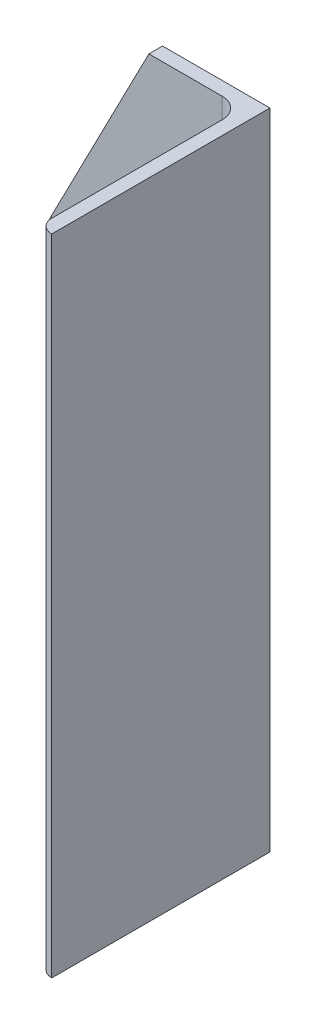
ISO-10303-21;
HEADER;
FILE_DESCRIPTION(('STEP AP214'),'2;1');
FILE_NAME('part.step','',(''),(''),'','','');
FILE_SCHEMA(('AUTOMOTIVE_DESIGN { 1 0 10303 214 1 1 1 1 }'));
ENDSEC;
DATA;
#1=APPLICATION_CONTEXT('core data for automotive mechanical design processes');
#2=APPLICATION_PROTOCOL_DEFINITION('international standard','automotive_design',2000,#1);
#3=PRODUCT_CONTEXT('',#1,'mechanical');
#4=PRODUCT('Part','Part','',(#3));
#5=PRODUCT_RELATED_PRODUCT_CATEGORY('part','',(#4));
#6=PRODUCT_DEFINITION_FORMATION('','',#4);
#7=PRODUCT_DEFINITION_CONTEXT('part definition',#1,'design');
#8=PRODUCT_DEFINITION('design','',#6,#7);
#9=PRODUCT_DEFINITION_SHAPE('','',#8);
#10=(LENGTH_UNIT() NAMED_UNIT(*) SI_UNIT(.MILLI.,.METRE.));
#11=(NAMED_UNIT(*) PLANE_ANGLE_UNIT() SI_UNIT($,.RADIAN.));
#12=(NAMED_UNIT(*) SI_UNIT($,.STERADIAN.) SOLID_ANGLE_UNIT());
#13=UNCERTAINTY_MEASURE_WITH_UNIT(LENGTH_MEASURE(1.E-05),#10,'distance_accuracy_value','');
#14=(GEOMETRIC_REPRESENTATION_CONTEXT(3) GLOBAL_UNCERTAINTY_ASSIGNED_CONTEXT((#13)) GLOBAL_UNIT_ASSIGNED_CONTEXT((#10,
#11,#12)) REPRESENTATION_CONTEXT('',''));
#15=CARTESIAN_POINT('',(0.,0.,0.));
#16=DIRECTION('',(0.,0.,1.));
#17=DIRECTION('',(1.,0.,0.));
#18=AXIS2_PLACEMENT_3D('',#15,#16,#17);
#19=CARTESIAN_POINT('',(-50.8,150.,0.));
#20=DIRECTION('',(0.,0.,1.));
#21=DIRECTION('',(1.,0.,0.));
#22=AXIS2_PLACEMENT_3D('',#19,#20,#21);
#23=PLANE('',#22);
#24=CARTESIAN_POINT('',(-17.9,9.88,0.));
#25=DIRECTION('',(0.,0.,-1.));
#26=DIRECTION('',(-1.,0.,0.));
#27=AXIS2_PLACEMENT_3D('',#24,#25,#26);
#28=CIRCLE('',#27,2.5);
#29=CARTESIAN_POINT('',(-20.4,9.88,0.));
#30=VERTEX_POINT('',#29);
#31=EDGE_CURVE('E338',#30,#30,#28,.T.);
#32=ORIENTED_EDGE('',*,*,#31,.F.);
#33=EDGE_LOOP('',(#32));
#34=FACE_BOUND('',#33,.T.);
#35=CARTESIAN_POINT('',(-45.4,90.13,0.));
#36=DIRECTION('',(0.,0.,-1.));
#37=DIRECTION('',(-1.,0.,0.));
#38=AXIS2_PLACEMENT_3D('',#35,#36,#37);
#39=CIRCLE('',#38,2.5);
#40=CARTESIAN_POINT('',(-47.9,90.13,0.));
#41=VERTEX_POINT('',#40);
#42=EDGE_CURVE('E342',#41,#41,#39,.T.);
#43=ORIENTED_EDGE('',*,*,#42,.F.);
#44=EDGE_LOOP('',(#43));
#45=FACE_BOUND('',#44,.T.);
#46=CARTESIAN_POINT('',(-17.9,90.13,0.));
#47=DIRECTION('',(0.,0.,-1.));
#48=DIRECTION('',(-1.,0.,0.));
#49=AXIS2_PLACEMENT_3D('',#46,#47,#48);
#50=CIRCLE('',#49,2.5);
#51=CARTESIAN_POINT('',(-20.4,90.13,0.));
#52=VERTEX_POINT('',#51);
#53=EDGE_CURVE('E346',#52,#52,#50,.T.);
#54=ORIENTED_EDGE('',*,*,#53,.F.);
#55=EDGE_LOOP('',(#54));
#56=FACE_BOUND('',#55,.T.);
#57=CARTESIAN_POINT('',(-45.4,9.88,0.));
#58=DIRECTION('',(0.,0.,-1.));
#59=DIRECTION('',(-1.,0.,0.));
#60=AXIS2_PLACEMENT_3D('',#57,#58,#59);
#61=CIRCLE('',#60,2.5);
#62=CARTESIAN_POINT('',(-47.9,9.88,0.));
#63=VERTEX_POINT('',#62);
#64=EDGE_CURVE('E160',#63,#63,#61,.T.);
#65=ORIENTED_EDGE('',*,*,#64,.F.);
#66=EDGE_LOOP('',(#65));
#67=FACE_BOUND('',#66,.T.);
#68=DIRECTION('',(0.,-1.,0.));
#69=VECTOR('',#68,1.);
#70=CARTESIAN_POINT('',(-50.8,150.,0.));
#71=LINE('',#70,#69);
#72=CARTESIAN_POINT('',(-50.8,100.,0.));
#73=VERTEX_POINT('',#72);
#74=CARTESIAN_POINT('',(-50.8,0.,0.));
#75=VERTEX_POINT('',#74);
#76=EDGE_CURVE('E77',#73,#75,#71,.T.);
#77=ORIENTED_EDGE('',*,*,#76,.F.);
#78=DIRECTION('',(-0.45855237116426,-0.888667385977248,0.));
#79=VECTOR('',#78,1.);
#80=CARTESIAN_POINT('',(-50.8,100.,0.));
#81=LINE('',#80,#79);
#82=CARTESIAN_POINT('',(-25.,150.,0.));
#83=VERTEX_POINT('',#82);
#84=EDGE_CURVE('E274',#83,#73,#81,.T.);
#85=ORIENTED_EDGE('',*,*,#84,.F.);
#86=DIRECTION('',(-1.,0.,0.));
#87=VECTOR('',#86,1.);
#88=CARTESIAN_POINT('',(-50.8,150.,0.));
#89=LINE('',#88,#87);
#90=CARTESIAN_POINT('',(0.,150.,0.));
#91=VERTEX_POINT('',#90);
#92=EDGE_CURVE('E226',#91,#83,#89,.T.);
#93=ORIENTED_EDGE('',*,*,#92,.F.);
#94=DIRECTION('',(0.,-1.,0.));
#95=VECTOR('',#94,1.);
#96=CARTESIAN_POINT('',(0.,150.,0.));
#97=LINE('',#96,#95);
#98=CARTESIAN_POINT('',(0.,0.,0.));
#99=VERTEX_POINT('',#98);
#100=EDGE_CURVE('E203',#91,#99,#97,.T.);
#101=ORIENTED_EDGE('',*,*,#100,.T.);
#102=DIRECTION('',(-1.,0.,0.));
#103=VECTOR('',#102,1.);
#104=CARTESIAN_POINT('',(-50.8,0.,0.));
#105=LINE('',#104,#103);
#106=EDGE_CURVE('E196',#99,#75,#105,.T.);
#107=ORIENTED_EDGE('',*,*,#106,.T.);
#108=EDGE_LOOP('',(#77,#85,#93,#101,#107));
#109=FACE_BOUND('',#108,.T.);
#110=ADVANCED_FACE('F70',(#34,#45,#56,#67,#109),#23,.F.);
#111=CARTESIAN_POINT('',(-50.8,150.,0.00508));
#112=DIRECTION('',(1.,0.,0.));
#113=DIRECTION('',(0.,0.,-1.));
#114=AXIS2_PLACEMENT_3D('',#111,#112,#113);
#115=PLANE('',#114);
#116=DIRECTION('',(0.,-1.,0.));
#117=VECTOR('',#116,1.);
#118=CARTESIAN_POINT('',(-50.8,150.,0.00507999999999903));
#119=LINE('',#118,#117);
#120=CARTESIAN_POINT('',(-50.8,100.,0.00507999999999932));
#121=VERTEX_POINT('',#120);
#122=CARTESIAN_POINT('',(-50.8,0.,0.00507999999999903));
#123=VERTEX_POINT('',#122);
#124=EDGE_CURVE('E174',#121,#123,#119,.T.);
#125=ORIENTED_EDGE('',*,*,#124,.F.);
#126=DIRECTION('',(0.,0.,-1.));
#127=VECTOR('',#126,1.);
#128=CARTESIAN_POINT('',(-50.8,100.,10.));
#129=LINE('',#128,#127);
#130=EDGE_CURVE('E188',#121,#73,#129,.T.);
#131=ORIENTED_EDGE('',*,*,#130,.T.);
#132=ORIENTED_EDGE('',*,*,#76,.T.);
#133=DIRECTION('',(0.,0.,1.));
#134=VECTOR('',#133,1.);
#135=CARTESIAN_POINT('',(-50.8,0.,0.00508));
#136=LINE('',#135,#134);
#137=EDGE_CURVE('E186',#75,#123,#136,.T.);
#138=ORIENTED_EDGE('',*,*,#137,.T.);
#139=EDGE_LOOP('',(#125,#131,#132,#138));
#140=FACE_BOUND('',#139,.T.);
#141=ADVANCED_FACE('F185',(#140),#115,.F.);
#142=CARTESIAN_POINT('',(-47.63008,150.,0.00507999999999961));
#143=DIRECTION('',(0.,-1.,0.));
#144=DIRECTION('',(0.,0.,-1.));
#145=AXIS2_PLACEMENT_3D('',#142,#143,#144);
#146=CYLINDRICAL_SURFACE('',#145,3.16992);
#147=DIRECTION('',(0.,-1.,0.));
#148=VECTOR('',#147,1.);
#149=CARTESIAN_POINT('',(-47.63008,150.,3.175));
#150=LINE('',#149,#148);
#151=CARTESIAN_POINT('',(-47.63008,89.0000693854931,3.175));
#152=VERTEX_POINT('',#151);
#153=CARTESIAN_POINT('',(-47.63008,11.0099306145069,3.175));
#154=VERTEX_POINT('',#153);
#155=EDGE_CURVE('E165',#152,#154,#150,.T.);
#156=ORIENTED_EDGE('',*,*,#155,.F.);
#157=CARTESIAN_POINT('',(-47.63008,89.000069385493,3.175));
#158=CARTESIAN_POINT('',(-47.6618475369519,89.06275257543,3.17498825386718));
#159=CARTESIAN_POINT('',(-47.6909571313549,89.1267747988788,3.17452202136379));
#160=CARTESIAN_POINT('',(-47.7436844984121,89.2570330562254,3.17307653014145));
#161=CARTESIAN_POINT('',(-47.7673025764054,89.3232689668035,3.17209729995602));
#162=CARTESIAN_POINT('',(-47.8088536086666,89.4574298127035,3.17002271590357));
#163=CARTESIAN_POINT('',(-47.8267922655728,89.5253529794716,3.16892748000104));
#164=CARTESIAN_POINT('',(-47.8568940839173,89.6624494456906,3.16691008522322));
#165=CARTESIAN_POINT('',(-47.8690573815136,89.7316227156296,3.16598792226793));
#166=CARTESIAN_POINT('',(-47.896745028122,89.9404179672758,3.16382725140115));
#167=CARTESIAN_POINT('',(-47.903469075125,90.0813216868399,3.16319441979677));
#168=CARTESIAN_POINT('',(-47.8931648052193,90.3621172625641,3.16406673585142));
#169=CARTESIAN_POINT('',(-47.8761492563123,90.5020096220033,3.16557073425502));
#170=CARTESIAN_POINT('',(-47.825139033339,90.7470805565183,3.16906803220342));
#171=CARTESIAN_POINT('',(-47.7956280632721,90.8532067770281,3.17088442589496));
#172=CARTESIAN_POINT('',(-47.7411179320655,91.00874356221,3.17310619479403));
#173=CARTESIAN_POINT('',(-47.7212373297196,91.0599868802706,3.17376303397266));
#174=CARTESIAN_POINT('',(-47.6781399771871,91.1610659973172,3.17470823686071));
#175=CARTESIAN_POINT('',(-47.6549225731832,91.2109015181624,3.17499652824661));
#176=CARTESIAN_POINT('',(-47.63008,91.2599306145069,3.175));
#177=B_SPLINE_CURVE_WITH_KNOTS('',3,(#157,#158,#159,#160,#161,#162,#163,#164,#165,#166,#167,
#168,#169,#170,#171,#172,#173,#174,#175,#176),.UNSPECIFIED.,.F.,.F.,(4,2,2,2,2,2,2,2,2,4),(0.,
0.210745618921381,0.421479517172309,0.632001144014757,0.842517807417941,1.26353161159737,
1.68431906680412,2.01383038404872,2.1786292729392,2.34346049687307),.UNSPECIFIED.);
#178=CARTESIAN_POINT('',(-47.63008,91.2599306145069,3.175));
#179=VERTEX_POINT('',#178);
#180=EDGE_CURVE('E90',#152,#179,#177,.T.);
#181=ORIENTED_EDGE('',*,*,#180,.T.);
#182=CARTESIAN_POINT('',(-47.63008,106.143255813953,3.175));
#183=VERTEX_POINT('',#182);
#184=EDGE_CURVE('E172',#183,#179,#150,.T.);
#185=ORIENTED_EDGE('',*,*,#184,.F.);
#186=CARTESIAN_POINT('',(-47.63008,106.143255813954,0.00507999999999961));
#187=DIRECTION('',(0.888667385977248,-0.45855237116426,0.));
#188=DIRECTION('',(-0.45855237116426,-0.888667385977248,0.));
#189=AXIS2_PLACEMENT_3D('',#186,#187,#188);
#190=ELLIPSE('',#189,6.91288541797659,3.16992);
#191=EDGE_CURVE('E204',#183,#121,#190,.T.);
#192=ORIENTED_EDGE('',*,*,#191,.T.);
#193=ORIENTED_EDGE('',*,*,#124,.T.);
#194=CARTESIAN_POINT('',(-47.63008,0.,0.00507999999999961));
#195=DIRECTION('',(0.,1.,0.));
#196=DIRECTION('',(0.,0.,1.));
#197=AXIS2_PLACEMENT_3D('',#194,#195,#196);
#198=CIRCLE('',#197,3.16992);
#199=CARTESIAN_POINT('',(-47.63008,0.,3.175));
#200=VERTEX_POINT('',#199);
#201=EDGE_CURVE('E198',#123,#200,#198,.T.);
#202=ORIENTED_EDGE('',*,*,#201,.T.);
#203=CARTESIAN_POINT('',(-47.63008,8.75006938549308,3.175));
#204=VERTEX_POINT('',#203);
#205=EDGE_CURVE('E167',#204,#200,#150,.T.);
#206=ORIENTED_EDGE('',*,*,#205,.F.);
#207=CARTESIAN_POINT('',(-47.63008,8.75006938549305,3.175));
#208=CARTESIAN_POINT('',(-47.6618475369519,8.81275257542995,3.17498825386718));
#209=CARTESIAN_POINT('',(-47.6909571313549,8.87677479887876,3.17452202136379));
#210=CARTESIAN_POINT('',(-47.7436844984121,9.00703305622537,3.17307653014145));
#211=CARTESIAN_POINT('',(-47.7673025764054,9.07326896680352,3.17209729995602));
#212=CARTESIAN_POINT('',(-47.8088536086666,9.20742981270352,3.17002271590357));
#213=CARTESIAN_POINT('',(-47.8267922655728,9.27535297947159,3.16892748000104));
#214=CARTESIAN_POINT('',(-47.8568940839173,9.41244944569062,3.16691008522322));
#215=CARTESIAN_POINT('',(-47.8690573815136,9.48162271562962,3.16598792226793));
#216=CARTESIAN_POINT('',(-47.896745028122,9.69041796727582,3.16382725140115));
#217=CARTESIAN_POINT('',(-47.903469075125,9.83132168683984,3.16319441979677));
#218=CARTESIAN_POINT('',(-47.8931648052193,10.112117262564,3.16406673585142));
#219=CARTESIAN_POINT('',(-47.8761492563123,10.2520096220033,3.16557073425502));
#220=CARTESIAN_POINT('',(-47.825139033339,10.4970805565183,3.16906803220342));
#221=CARTESIAN_POINT('',(-47.7956280632721,10.6032067770281,3.17088442589496));
#222=CARTESIAN_POINT('',(-47.7411179320655,10.75874356221,3.17310619479403));
#223=CARTESIAN_POINT('',(-47.7212373297196,10.8099868802706,3.17376303397266));
#224=CARTESIAN_POINT('',(-47.6781399771871,10.9110659973172,3.17470823686071));
#225=CARTESIAN_POINT('',(-47.6549225731832,10.9609015181624,3.17499652824661));
#226=CARTESIAN_POINT('',(-47.63008,11.0099306145069,3.175));
#227=B_SPLINE_CURVE_WITH_KNOTS('',3,(#207,#208,#209,#210,#211,#212,#213,#214,#215,#216,#217,
#218,#219,#220,#221,#222,#223,#224,#225,#226),.UNSPECIFIED.,.F.,.F.,(4,2,2,2,2,2,2,2,2,4),(0.,
0.210745618921378,0.421479517172302,0.632001144014749,0.842517807417936,1.26353161159737,
1.68431906680411,2.01383038404872,2.1786292729392,2.34346049687306),.UNSPECIFIED.);
#228=EDGE_CURVE('E83',#204,#154,#227,.T.);
#229=ORIENTED_EDGE('',*,*,#228,.T.);
#230=EDGE_LOOP('',(#156,#181,#185,#192,#193,#202,#206,#229));
#231=FACE_BOUND('',#230,.T.);
#232=ADVANCED_FACE('F164',(#231),#146,.T.);
#233=CARTESIAN_POINT('',(-7.93750000000001,150.,3.17499999999999));
#234=DIRECTION('',(0.,0.,-1.));
#235=DIRECTION('',(-1.,0.,0.));
#236=AXIS2_PLACEMENT_3D('',#233,#234,#235);
#237=PLANE('',#236);
#238=CARTESIAN_POINT('',(-17.9,9.88,3.17499999999999));
#239=DIRECTION('',(0.,0.,-1.));
#240=DIRECTION('',(-1.,0.,0.));
#241=AXIS2_PLACEMENT_3D('',#238,#239,#240);
#242=CIRCLE('',#241,2.5);
#243=CARTESIAN_POINT('',(-20.4,9.88,3.17499999999999));
#244=VERTEX_POINT('',#243);
#245=EDGE_CURVE('E349',#244,#244,#242,.F.);
#246=ORIENTED_EDGE('',*,*,#245,.F.);
#247=EDGE_LOOP('',(#246));
#248=FACE_BOUND('',#247,.T.);
#249=CARTESIAN_POINT('',(-17.9,90.13,3.17499999999999));
#250=DIRECTION('',(0.,0.,-1.));
#251=DIRECTION('',(-1.,0.,0.));
#252=AXIS2_PLACEMENT_3D('',#249,#250,#251);
#253=CIRCLE('',#252,2.5);
#254=CARTESIAN_POINT('',(-20.4,90.13,3.17499999999999));
#255=VERTEX_POINT('',#254);
#256=EDGE_CURVE('E355',#255,#255,#253,.F.);
#257=ORIENTED_EDGE('',*,*,#256,.F.);
#258=EDGE_LOOP('',(#257));
#259=FACE_BOUND('',#258,.T.);
#260=ORIENTED_EDGE('',*,*,#184,.T.);
#261=CARTESIAN_POINT('',(-45.4,90.13,3.175));
#262=DIRECTION('',(0.,0.,-1.));
#263=DIRECTION('',(-1.,0.,0.));
#264=AXIS2_PLACEMENT_3D('',#261,#262,#263);
#265=CIRCLE('',#264,2.5);
#266=EDGE_CURVE('E171',#152,#179,#265,.F.);
#267=ORIENTED_EDGE('',*,*,#266,.F.);
#268=ORIENTED_EDGE('',*,*,#155,.T.);
#269=CARTESIAN_POINT('',(-45.4,9.88,3.175));
#270=DIRECTION('',(0.,0.,-1.));
#271=DIRECTION('',(-1.,0.,0.));
#272=AXIS2_PLACEMENT_3D('',#269,#270,#271);
#273=CIRCLE('',#272,2.5);
#274=EDGE_CURVE('E155',#204,#154,#273,.F.);
#275=ORIENTED_EDGE('',*,*,#274,.F.);
#276=ORIENTED_EDGE('',*,*,#205,.T.);
#277=DIRECTION('',(1.,0.,0.));
#278=VECTOR('',#277,1.);
#279=CARTESIAN_POINT('',(-7.93750000000001,0.,3.17499999999999));
#280=LINE('',#279,#278);
#281=CARTESIAN_POINT('',(-7.93750000000001,0.,3.17499999999999));
#282=VERTEX_POINT('',#281);
#283=EDGE_CURVE('E214',#200,#282,#280,.T.);
#284=ORIENTED_EDGE('',*,*,#283,.T.);
#285=DIRECTION('',(0.,-1.,0.));
#286=VECTOR('',#285,1.);
#287=CARTESIAN_POINT('',(-7.93750000000001,150.,3.17499999999999));
#288=LINE('',#287,#286);
#289=CARTESIAN_POINT('',(-7.93750000000001,150.,3.17499999999999));
#290=VERTEX_POINT('',#289);
#291=EDGE_CURVE('E175',#290,#282,#288,.T.);
#292=ORIENTED_EDGE('',*,*,#291,.F.);
#293=DIRECTION('',(1.,0.,0.));
#294=VECTOR('',#293,1.);
#295=CARTESIAN_POINT('',(-7.93750000000001,150.,3.17499999999999));
#296=LINE('',#295,#294);
#297=CARTESIAN_POINT('',(-25.,150.,3.17499999999999));
#298=VERTEX_POINT('',#297);
#299=EDGE_CURVE('E267',#298,#290,#296,.T.);
#300=ORIENTED_EDGE('',*,*,#299,.F.);
#301=DIRECTION('',(-0.45855237116426,-0.888667385977248,0.));
#302=VECTOR('',#301,1.);
#303=CARTESIAN_POINT('',(-21.412263396975,156.952977912839,3.17499999999999));
#304=LINE('',#303,#302);
#305=EDGE_CURVE('E207',#298,#183,#304,.T.);
#306=ORIENTED_EDGE('',*,*,#305,.T.);
#307=EDGE_LOOP('',(#260,#267,#268,#275,#276,#284,#292,#300,#306));
#308=FACE_BOUND('',#307,.T.);
#309=ADVANCED_FACE('F170',(#248,#259,#308),#237,.F.);
#310=CARTESIAN_POINT('',(-7.93750000000001,150.,7.93749999999999));
#311=DIRECTION('',(0.,-1.,0.));
#312=DIRECTION('',(0.,0.,-1.));
#313=AXIS2_PLACEMENT_3D('',#310,#311,#312);
#314=CYLINDRICAL_SURFACE('',#313,4.7625);
#315=CARTESIAN_POINT('',(-7.93750000000001,0.,7.93749999999999));
#316=DIRECTION('',(0.,-1.,0.));
#317=DIRECTION('',(0.,0.,-1.));
#318=AXIS2_PLACEMENT_3D('',#315,#316,#317);
#319=CIRCLE('',#318,4.7625);
#320=CARTESIAN_POINT('',(-3.17500000000001,0.,7.93749999999999));
#321=VERTEX_POINT('',#320);
#322=EDGE_CURVE('E216',#282,#321,#319,.T.);
#323=ORIENTED_EDGE('',*,*,#322,.T.);
#324=DIRECTION('',(0.,-1.,0.));
#325=VECTOR('',#324,1.);
#326=CARTESIAN_POINT('',(-3.17500000000001,150.,7.93749999999999));
#327=LINE('',#326,#325);
#328=CARTESIAN_POINT('',(-3.17500000000001,150.,7.93749999999999));
#329=VERTEX_POINT('',#328);
#330=EDGE_CURVE('E236',#329,#321,#327,.T.);
#331=ORIENTED_EDGE('',*,*,#330,.F.);
#332=CARTESIAN_POINT('',(-7.93750000000001,150.,7.93749999999999));
#333=DIRECTION('',(0.,-1.,0.));
#334=DIRECTION('',(0.,0.,-1.));
#335=AXIS2_PLACEMENT_3D('',#332,#333,#334);
#336=CIRCLE('',#335,4.7625);
#337=EDGE_CURVE('E248',#290,#329,#336,.T.);
#338=ORIENTED_EDGE('',*,*,#337,.F.);
#339=ORIENTED_EDGE('',*,*,#291,.T.);
#340=EDGE_LOOP('',(#323,#331,#338,#339));
#341=FACE_BOUND('',#340,.T.);
#342=ADVANCED_FACE('F247',(#341),#314,.F.);
#343=CARTESIAN_POINT('',(-3.175,150.,47.63008));
#344=DIRECTION('',(1.,0.,0.));
#345=DIRECTION('',(0.,0.,-1.));
#346=AXIS2_PLACEMENT_3D('',#343,#344,#345);
#347=PLANE('',#346);
#348=DIRECTION('',(0.,0.,1.));
#349=VECTOR('',#348,1.);
#350=CARTESIAN_POINT('',(-3.175,0.,47.63008));
#351=LINE('',#350,#349);
#352=CARTESIAN_POINT('',(-3.175,0.,47.63008));
#353=VERTEX_POINT('',#352);
#354=EDGE_CURVE('E218',#321,#353,#351,.T.);
#355=ORIENTED_EDGE('',*,*,#354,.T.);
#356=DIRECTION('',(0.,-1.,0.));
#357=VECTOR('',#356,1.);
#358=CARTESIAN_POINT('',(-3.175,150.,47.63008));
#359=LINE('',#358,#357);
#360=CARTESIAN_POINT('',(-3.175,150.,47.63008));
#361=VERTEX_POINT('',#360);
#362=EDGE_CURVE('E234',#361,#353,#359,.T.);
#363=ORIENTED_EDGE('',*,*,#362,.F.);
#364=DIRECTION('',(0.,0.,1.));
#365=VECTOR('',#364,1.);
#366=CARTESIAN_POINT('',(-3.175,150.,47.63008));
#367=LINE('',#366,#365);
#368=EDGE_CURVE('E262',#329,#361,#367,.T.);
#369=ORIENTED_EDGE('',*,*,#368,.F.);
#370=ORIENTED_EDGE('',*,*,#330,.T.);
#371=EDGE_LOOP('',(#355,#363,#369,#370));
#372=FACE_BOUND('',#371,.T.);
#373=ADVANCED_FACE('F253',(#372),#347,.F.);
#374=CARTESIAN_POINT('',(-0.00508000000000019,150.,47.63008));
#375=DIRECTION('',(0.,-1.,0.));
#376=DIRECTION('',(0.,0.,-1.));
#377=AXIS2_PLACEMENT_3D('',#374,#375,#376);
#378=CYLINDRICAL_SURFACE('',#377,3.16992);
#379=CARTESIAN_POINT('',(-0.00508000000000019,0.,47.63008));
#380=DIRECTION('',(0.,1.,0.));
#381=DIRECTION('',(0.,0.,-1.));
#382=AXIS2_PLACEMENT_3D('',#379,#380,#381);
#383=CIRCLE('',#382,3.16992);
#384=CARTESIAN_POINT('',(-0.00508,0.,50.8));
#385=VERTEX_POINT('',#384);
#386=EDGE_CURVE('E220',#353,#385,#383,.T.);
#387=ORIENTED_EDGE('',*,*,#386,.T.);
#388=DIRECTION('',(0.,-1.,0.));
#389=VECTOR('',#388,1.);
#390=CARTESIAN_POINT('',(-0.00508,150.,50.8));
#391=LINE('',#390,#389);
#392=CARTESIAN_POINT('',(-0.00508,150.,50.8));
#393=VERTEX_POINT('',#392);
#394=EDGE_CURVE('E231',#393,#385,#391,.T.);
#395=ORIENTED_EDGE('',*,*,#394,.F.);
#396=CARTESIAN_POINT('',(-0.00508000000000019,150.,47.63008));
#397=DIRECTION('',(0.,1.,0.));
#398=DIRECTION('',(0.,0.,-1.));
#399=AXIS2_PLACEMENT_3D('',#396,#397,#398);
#400=CIRCLE('',#399,3.16992);
#401=EDGE_CURVE('E258',#361,#393,#400,.T.);
#402=ORIENTED_EDGE('',*,*,#401,.F.);
#403=ORIENTED_EDGE('',*,*,#362,.T.);
#404=EDGE_LOOP('',(#387,#395,#402,#403));
#405=FACE_BOUND('',#404,.T.);
#406=ADVANCED_FACE('F256',(#405),#378,.T.);
#407=CARTESIAN_POINT('',(0.,150.,50.8));
#408=DIRECTION('',(0.,0.,-1.));
#409=DIRECTION('',(-1.,0.,0.));
#410=AXIS2_PLACEMENT_3D('',#407,#408,#409);
#411=PLANE('',#410);
#412=DIRECTION('',(1.,0.,0.));
#413=VECTOR('',#412,1.);
#414=CARTESIAN_POINT('',(0.,0.,50.8));
#415=LINE('',#414,#413);
#416=CARTESIAN_POINT('',(0.,0.,50.8));
#417=VERTEX_POINT('',#416);
#418=EDGE_CURVE('E222',#385,#417,#415,.T.);
#419=ORIENTED_EDGE('',*,*,#418,.T.);
#420=DIRECTION('',(0.,-1.,0.));
#421=VECTOR('',#420,1.);
#422=CARTESIAN_POINT('',(0.,150.,50.8));
#423=LINE('',#422,#421);
#424=CARTESIAN_POINT('',(0.,150.,50.8));
#425=VERTEX_POINT('',#424);
#426=EDGE_CURVE('E228',#425,#417,#423,.T.);
#427=ORIENTED_EDGE('',*,*,#426,.F.);
#428=DIRECTION('',(1.,0.,0.));
#429=VECTOR('',#428,1.);
#430=CARTESIAN_POINT('',(0.,150.,50.8));
#431=LINE('',#430,#429);
#432=EDGE_CURVE('E261',#393,#425,#431,.T.);
#433=ORIENTED_EDGE('',*,*,#432,.F.);
#434=ORIENTED_EDGE('',*,*,#394,.T.);
#435=EDGE_LOOP('',(#419,#427,#433,#434));
#436=FACE_BOUND('',#435,.T.);
#437=ADVANCED_FACE('F313',(#436),#411,.F.);
#438=CARTESIAN_POINT('',(0.,150.,0.));
#439=DIRECTION('',(-1.,0.,0.));
#440=DIRECTION('',(0.,0.,1.));
#441=AXIS2_PLACEMENT_3D('',#438,#439,#440);
#442=PLANE('',#441);
#443=DIRECTION('',(0.,0.,-1.));
#444=VECTOR('',#443,1.);
#445=CARTESIAN_POINT('',(0.,0.,0.));
#446=LINE('',#445,#444);
#447=EDGE_CURVE('E224',#417,#99,#446,.T.);
#448=ORIENTED_EDGE('',*,*,#447,.T.);
#449=ORIENTED_EDGE('',*,*,#100,.F.);
#450=DIRECTION('',(0.,0.,-1.));
#451=VECTOR('',#450,1.);
#452=CARTESIAN_POINT('',(0.,150.,0.));
#453=LINE('',#452,#451);
#454=EDGE_CURVE('E210',#425,#91,#453,.T.);
#455=ORIENTED_EDGE('',*,*,#454,.F.);
#456=ORIENTED_EDGE('',*,*,#426,.T.);
#457=EDGE_LOOP('',(#448,#449,#455,#456));
#458=FACE_BOUND('',#457,.T.);
#459=ADVANCED_FACE('F308',(#458),#442,.F.);
#460=CARTESIAN_POINT('',(-0.00508000000000019,150.,47.63008));
#461=DIRECTION('',(0.,-1.,0.));
#462=DIRECTION('',(0.,0.,-1.));
#463=AXIS2_PLACEMENT_3D('',#460,#461,#462);
#464=PLANE('',#463);
#465=ORIENTED_EDGE('',*,*,#92,.T.);
#466=DIRECTION('',(0.,0.,1.));
#467=VECTOR('',#466,1.);
#468=CARTESIAN_POINT('',(-25.,150.,47.63008));
#469=LINE('',#468,#467);
#470=EDGE_CURVE('E13',#83,#298,#469,.T.);
#471=ORIENTED_EDGE('',*,*,#470,.T.);
#472=ORIENTED_EDGE('',*,*,#299,.T.);
#473=ORIENTED_EDGE('',*,*,#337,.T.);
#474=ORIENTED_EDGE('',*,*,#368,.T.);
#475=ORIENTED_EDGE('',*,*,#401,.T.);
#476=ORIENTED_EDGE('',*,*,#432,.T.);
#477=ORIENTED_EDGE('',*,*,#454,.T.);
#478=EDGE_LOOP('',(#465,#471,#472,#473,#474,#475,#476,#477));
#479=FACE_BOUND('',#478,.T.);
#480=ADVANCED_FACE('F305',(#479),#464,.F.);
#481=CARTESIAN_POINT('',(-0.00508000000000019,0.,47.63008));
#482=DIRECTION('',(0.,-1.,0.));
#483=DIRECTION('',(0.,0.,-1.));
#484=AXIS2_PLACEMENT_3D('',#481,#482,#483);
#485=PLANE('',#484);
#486=ORIENTED_EDGE('',*,*,#106,.F.);
#487=ORIENTED_EDGE('',*,*,#447,.F.);
#488=ORIENTED_EDGE('',*,*,#418,.F.);
#489=ORIENTED_EDGE('',*,*,#386,.F.);
#490=ORIENTED_EDGE('',*,*,#354,.F.);
#491=ORIENTED_EDGE('',*,*,#322,.F.);
#492=ORIENTED_EDGE('',*,*,#283,.F.);
#493=ORIENTED_EDGE('',*,*,#201,.F.);
#494=ORIENTED_EDGE('',*,*,#137,.F.);
#495=EDGE_LOOP('',(#486,#487,#488,#489,#490,#491,#492,#493,#494));
#496=FACE_BOUND('',#495,.T.);
#497=ADVANCED_FACE('F194',(#496),#485,.T.);
#498=CARTESIAN_POINT('',(-50.8,100.,10.));
#499=DIRECTION('',(0.888667385977248,-0.45855237116426,0.));
#500=DIRECTION('',(0.45855237116426,0.888667385977248,0.));
#501=AXIS2_PLACEMENT_3D('',#498,#499,#500);
#502=PLANE('',#501);
#503=ORIENTED_EDGE('',*,*,#305,.F.);
#504=ORIENTED_EDGE('',*,*,#470,.F.);
#505=ORIENTED_EDGE('',*,*,#84,.T.);
#506=ORIENTED_EDGE('',*,*,#130,.F.);
#507=ORIENTED_EDGE('',*,*,#191,.F.);
#508=EDGE_LOOP('',(#503,#504,#505,#506,#507));
#509=FACE_BOUND('',#508,.T.);
#510=ADVANCED_FACE('F300',(#509),#502,.F.);
#511=CARTESIAN_POINT('',(-45.4,9.88,10.2460678118655));
#512=DIRECTION('',(0.,0.,-1.));
#513=DIRECTION('',(-1.,0.,0.));
#514=AXIS2_PLACEMENT_3D('',#511,#512,#513);
#515=CYLINDRICAL_SURFACE('',#514,2.5);
#516=ORIENTED_EDGE('',*,*,#64,.T.);
#517=EDGE_LOOP('',(#516));
#518=FACE_BOUND('',#517,.T.);
#519=ORIENTED_EDGE('',*,*,#274,.T.);
#520=ORIENTED_EDGE('',*,*,#228,.F.);
#521=EDGE_LOOP('',(#519,#520));
#522=FACE_BOUND('',#521,.T.);
#523=ADVANCED_FACE('F156',(#518,#522),#515,.F.);
#524=CARTESIAN_POINT('',(-17.9,90.13,10.2460678118655));
#525=DIRECTION('',(0.,0.,-1.));
#526=DIRECTION('',(-1.,0.,0.));
#527=AXIS2_PLACEMENT_3D('',#524,#525,#526);
#528=CYLINDRICAL_SURFACE('',#527,2.5);
#529=CARTESIAN_POINT('',(-20.4,90.13,3.17499999999999));
#530=CARTESIAN_POINT('',(-20.4,90.13,3.14192708333333));
#531=CARTESIAN_POINT('',(-20.4,90.13,3.10885416666666));
#532=CARTESIAN_POINT('',(-20.4,90.13,3.04270833333333));
#533=CARTESIAN_POINT('',(-20.4,90.13,3.00963541666666));
#534=CARTESIAN_POINT('',(-20.4,90.13,2.94348958333333));
#535=CARTESIAN_POINT('',(-20.4,90.13,2.91041666666666));
#536=CARTESIAN_POINT('',(-20.4,90.13,2.84427083333333));
#537=CARTESIAN_POINT('',(-20.4,90.13,2.81119791666666));
#538=CARTESIAN_POINT('',(-20.4,90.13,2.74505208333333));
#539=CARTESIAN_POINT('',(-20.4,90.13,2.71197916666666));
#540=CARTESIAN_POINT('',(-20.4,90.13,2.64583333333333));
#541=CARTESIAN_POINT('',(-20.4,90.13,2.61276041666666));
#542=CARTESIAN_POINT('',(-20.4,90.13,2.54661458333333));
#543=CARTESIAN_POINT('',(-20.4,90.13,2.51354166666666));
#544=CARTESIAN_POINT('',(-20.4,90.13,2.44739583333333));
#545=CARTESIAN_POINT('',(-20.4,90.13,2.41432291666666));
#546=CARTESIAN_POINT('',(-20.4,90.13,2.34817708333333));
#547=CARTESIAN_POINT('',(-20.4,90.13,2.31510416666666));
#548=CARTESIAN_POINT('',(-20.4,90.13,2.24895833333333));
#549=CARTESIAN_POINT('',(-20.4,90.13,2.21588541666666));
#550=CARTESIAN_POINT('',(-20.4,90.13,2.14973958333333));
#551=CARTESIAN_POINT('',(-20.4,90.13,2.11666666666666));
#552=CARTESIAN_POINT('',(-20.4,90.13,2.05052083333333));
#553=CARTESIAN_POINT('',(-20.4,90.13,2.01744791666667));
#554=CARTESIAN_POINT('',(-20.4,90.13,1.95130208333333));
#555=CARTESIAN_POINT('',(-20.4,90.13,1.91822916666666));
#556=CARTESIAN_POINT('',(-20.4,90.13,1.85208333333333));
#557=CARTESIAN_POINT('',(-20.4,90.13,1.81901041666666));
#558=CARTESIAN_POINT('',(-20.4,90.13,1.75286458333333));
#559=CARTESIAN_POINT('',(-20.4,90.13,1.71979166666666));
#560=CARTESIAN_POINT('',(-20.4,90.13,1.65364583333333));
#561=CARTESIAN_POINT('',(-20.4,90.13,1.62057291666667));
#562=CARTESIAN_POINT('',(-20.4,90.13,1.55442708333333));
#563=CARTESIAN_POINT('',(-20.4,90.13,1.52135416666667));
#564=CARTESIAN_POINT('',(-20.4,90.13,1.45520833333333));
#565=CARTESIAN_POINT('',(-20.4,90.13,1.42213541666667));
#566=CARTESIAN_POINT('',(-20.4,90.13,1.35598958333333));
#567=CARTESIAN_POINT('',(-20.4,90.13,1.32291666666667));
#568=CARTESIAN_POINT('',(-20.4,90.13,1.25677083333333));
#569=CARTESIAN_POINT('',(-20.4,90.13,1.22369791666667));
#570=CARTESIAN_POINT('',(-20.4,90.13,1.15755208333333));
#571=CARTESIAN_POINT('',(-20.4,90.13,1.12447916666667));
#572=CARTESIAN_POINT('',(-20.4,90.13,1.05833333333333));
#573=CARTESIAN_POINT('',(-20.4,90.13,1.02526041666667));
#574=CARTESIAN_POINT('',(-20.4,90.13,0.959114583333334));
#575=CARTESIAN_POINT('',(-20.4,90.13,0.926041666666667));
#576=CARTESIAN_POINT('',(-20.4,90.13,0.859895833333334));
#577=CARTESIAN_POINT('',(-20.4,90.13,0.826822916666668));
#578=CARTESIAN_POINT('',(-20.4,90.13,0.760677083333334));
#579=CARTESIAN_POINT('',(-20.4,90.13,0.727604166666667));
#580=CARTESIAN_POINT('',(-20.4,90.13,0.661458333333333));
#581=CARTESIAN_POINT('',(-20.4,90.13,0.628385416666667));
#582=CARTESIAN_POINT('',(-20.4,90.13,0.562239583333334));
#583=CARTESIAN_POINT('',(-20.4,90.13,0.529166666666667));
#584=CARTESIAN_POINT('',(-20.4,90.13,0.463020833333334));
#585=CARTESIAN_POINT('',(-20.4,90.13,0.429947916666668));
#586=CARTESIAN_POINT('',(-20.4,90.13,0.363802083333335));
#587=CARTESIAN_POINT('',(-20.4,90.13,0.330729166666668));
#588=CARTESIAN_POINT('',(-20.4,90.13,0.264583333333335));
#589=CARTESIAN_POINT('',(-20.4,90.13,0.231510416666668));
#590=CARTESIAN_POINT('',(-20.4,90.13,0.165364583333334));
#591=CARTESIAN_POINT('',(-20.4,90.13,0.132291666666668));
#592=CARTESIAN_POINT('',(-20.4,90.13,0.0661458333333347));
#593=CARTESIAN_POINT('',(-20.4,90.13,0.0330729166666682));
#594=CARTESIAN_POINT('',(-20.4,90.13,0.));
#595=B_SPLINE_CURVE_WITH_KNOTS('',3,(#529,#530,#531,#532,#533,#534,#535,#536,#537,#538,#539,
#540,#541,#542,#543,#544,#545,#546,#547,#548,#549,#550,#551,#552,#553,#554,#555,#556,#557,#558,
#559,#560,#561,#562,#563,#564,#565,#566,#567,#568,#569,#570,#571,#572,#573,#574,#575,#576,#577,
#578,#579,#580,#581,#582,#583,#584,#585,#586,#587,#588,#589,#590,#591,#592,#593,#594),
.UNSPECIFIED.,.F.,.F.,(4,2,2,2,2,2,2,2,2,2,2,2,2,2,2,2,2,2,2,2,2,2,2,2,2,2,2,2,2,2,2,2,4),(0.,
0.0992187499999995,0.1984375,0.297656249999999,0.396875,0.496093749999999,0.595312499999999,
0.694531249999999,0.793749999999998,0.892968749999998,0.992187499999997,1.09140625,1.190625,
1.28984375,1.3890625,1.48828125,1.5875,1.68671875,1.7859375,1.88515624999999,1.984375,
2.08359375,2.18281249999999,2.28203124999999,2.38124999999999,2.48046874999999,2.57968749999999,
2.67890624999999,2.77812499999999,2.87734374999999,2.97656249999999,3.07578124999999,
3.17499999999999),.UNSPECIFIED.);
#596=EDGE_CURVE('BSEAM294',#255,#52,#595,.T.);
#597=ORIENTED_EDGE('',*,*,#256,.T.);
#598=ORIENTED_EDGE('',*,*,#53,.T.);
#599=ORIENTED_EDGE('',*,*,#596,.T.);
#600=ORIENTED_EDGE('',*,*,#596,.F.);
#601=EDGE_LOOP('',(#597,#599,#598,#600));
#602=FACE_BOUND('',#601,.T.);
#603=ADVANCED_FACE('F294',(#602),#528,.F.);
#604=CARTESIAN_POINT('',(-45.4,90.13,10.2460678118655));
#605=DIRECTION('',(0.,0.,-1.));
#606=DIRECTION('',(-1.,0.,0.));
#607=AXIS2_PLACEMENT_3D('',#604,#605,#606);
#608=CYLINDRICAL_SURFACE('',#607,2.5);
#609=ORIENTED_EDGE('',*,*,#42,.T.);
#610=EDGE_LOOP('',(#609));
#611=FACE_BOUND('',#610,.T.);
#612=ORIENTED_EDGE('',*,*,#266,.T.);
#613=ORIENTED_EDGE('',*,*,#180,.F.);
#614=EDGE_LOOP('',(#612,#613));
#615=FACE_BOUND('',#614,.T.);
#616=ADVANCED_FACE('F289',(#611,#615),#608,.F.);
#617=CARTESIAN_POINT('',(-17.9,9.88,10.2460678118655));
#618=DIRECTION('',(0.,0.,-1.));
#619=DIRECTION('',(-1.,0.,0.));
#620=AXIS2_PLACEMENT_3D('',#617,#618,#619);
#621=CYLINDRICAL_SURFACE('',#620,2.5);
#622=CARTESIAN_POINT('',(-20.4,9.88,3.17499999999999));
#623=CARTESIAN_POINT('',(-20.4,9.88,3.14192708333333));
#624=CARTESIAN_POINT('',(-20.4,9.88,3.10885416666666));
#625=CARTESIAN_POINT('',(-20.4,9.88,3.04270833333333));
#626=CARTESIAN_POINT('',(-20.4,9.88,3.00963541666666));
#627=CARTESIAN_POINT('',(-20.4,9.88,2.94348958333333));
#628=CARTESIAN_POINT('',(-20.4,9.88,2.91041666666666));
#629=CARTESIAN_POINT('',(-20.4,9.88,2.84427083333333));
#630=CARTESIAN_POINT('',(-20.4,9.88,2.81119791666666));
#631=CARTESIAN_POINT('',(-20.4,9.88,2.74505208333333));
#632=CARTESIAN_POINT('',(-20.4,9.88,2.71197916666666));
#633=CARTESIAN_POINT('',(-20.4,9.88,2.64583333333333));
#634=CARTESIAN_POINT('',(-20.4,9.88,2.61276041666666));
#635=CARTESIAN_POINT('',(-20.4,9.88,2.54661458333333));
#636=CARTESIAN_POINT('',(-20.4,9.88,2.51354166666666));
#637=CARTESIAN_POINT('',(-20.4,9.88,2.44739583333333));
#638=CARTESIAN_POINT('',(-20.4,9.88,2.41432291666666));
#639=CARTESIAN_POINT('',(-20.4,9.88,2.34817708333333));
#640=CARTESIAN_POINT('',(-20.4,9.88,2.31510416666666));
#641=CARTESIAN_POINT('',(-20.4,9.88,2.24895833333333));
#642=CARTESIAN_POINT('',(-20.4,9.88,2.21588541666666));
#643=CARTESIAN_POINT('',(-20.4,9.88,2.14973958333333));
#644=CARTESIAN_POINT('',(-20.4,9.88,2.11666666666666));
#645=CARTESIAN_POINT('',(-20.4,9.88,2.05052083333333));
#646=CARTESIAN_POINT('',(-20.4,9.88,2.01744791666667));
#647=CARTESIAN_POINT('',(-20.4,9.88,1.95130208333333));
#648=CARTESIAN_POINT('',(-20.4,9.88,1.91822916666666));
#649=CARTESIAN_POINT('',(-20.4,9.88,1.85208333333333));
#650=CARTESIAN_POINT('',(-20.4,9.88,1.81901041666666));
#651=CARTESIAN_POINT('',(-20.4,9.88,1.75286458333333));
#652=CARTESIAN_POINT('',(-20.4,9.88,1.71979166666666));
#653=CARTESIAN_POINT('',(-20.4,9.88,1.65364583333333));
#654=CARTESIAN_POINT('',(-20.4,9.88,1.62057291666667));
#655=CARTESIAN_POINT('',(-20.4,9.88,1.55442708333333));
#656=CARTESIAN_POINT('',(-20.4,9.88,1.52135416666667));
#657=CARTESIAN_POINT('',(-20.4,9.88,1.45520833333333));
#658=CARTESIAN_POINT('',(-20.4,9.88,1.42213541666667));
#659=CARTESIAN_POINT('',(-20.4,9.88,1.35598958333333));
#660=CARTESIAN_POINT('',(-20.4,9.88,1.32291666666667));
#661=CARTESIAN_POINT('',(-20.4,9.88,1.25677083333333));
#662=CARTESIAN_POINT('',(-20.4,9.88,1.22369791666667));
#663=CARTESIAN_POINT('',(-20.4,9.88,1.15755208333333));
#664=CARTESIAN_POINT('',(-20.4,9.88,1.12447916666667));
#665=CARTESIAN_POINT('',(-20.4,9.88,1.05833333333333));
#666=CARTESIAN_POINT('',(-20.4,9.88,1.02526041666667));
#667=CARTESIAN_POINT('',(-20.4,9.88,0.959114583333334));
#668=CARTESIAN_POINT('',(-20.4,9.88,0.926041666666667));
#669=CARTESIAN_POINT('',(-20.4,9.88,0.859895833333334));
#670=CARTESIAN_POINT('',(-20.4,9.88,0.826822916666668));
#671=CARTESIAN_POINT('',(-20.4,9.88,0.760677083333334));
#672=CARTESIAN_POINT('',(-20.4,9.88,0.727604166666667));
#673=CARTESIAN_POINT('',(-20.4,9.88,0.661458333333333));
#674=CARTESIAN_POINT('',(-20.4,9.88,0.628385416666667));
#675=CARTESIAN_POINT('',(-20.4,9.88,0.562239583333334));
#676=CARTESIAN_POINT('',(-20.4,9.88,0.529166666666667));
#677=CARTESIAN_POINT('',(-20.4,9.88,0.463020833333334));
#678=CARTESIAN_POINT('',(-20.4,9.88,0.429947916666668));
#679=CARTESIAN_POINT('',(-20.4,9.88,0.363802083333335));
#680=CARTESIAN_POINT('',(-20.4,9.88,0.330729166666668));
#681=CARTESIAN_POINT('',(-20.4,9.88,0.264583333333335));
#682=CARTESIAN_POINT('',(-20.4,9.88,0.231510416666668));
#683=CARTESIAN_POINT('',(-20.4,9.88,0.165364583333334));
#684=CARTESIAN_POINT('',(-20.4,9.88,0.132291666666668));
#685=CARTESIAN_POINT('',(-20.4,9.88,0.0661458333333347));
#686=CARTESIAN_POINT('',(-20.4,9.88,0.0330729166666682));
#687=CARTESIAN_POINT('',(-20.4,9.88,0.));
#688=B_SPLINE_CURVE_WITH_KNOTS('',3,(#622,#623,#624,#625,#626,#627,#628,#629,#630,#631,#632,
#633,#634,#635,#636,#637,#638,#639,#640,#641,#642,#643,#644,#645,#646,#647,#648,#649,#650,#651,
#652,#653,#654,#655,#656,#657,#658,#659,#660,#661,#662,#663,#664,#665,#666,#667,#668,#669,#670,
#671,#672,#673,#674,#675,#676,#677,#678,#679,#680,#681,#682,#683,#684,#685,#686,#687),
.UNSPECIFIED.,.F.,.F.,(4,2,2,2,2,2,2,2,2,2,2,2,2,2,2,2,2,2,2,2,2,2,2,2,2,2,2,2,2,2,2,2,4),(0.,
0.0992187499999995,0.1984375,0.297656249999999,0.396875,0.496093749999999,0.595312499999999,
0.694531249999999,0.793749999999998,0.892968749999998,0.992187499999997,1.09140625,1.190625,
1.28984375,1.3890625,1.48828125,1.5875,1.68671875,1.7859375,1.88515624999999,1.984375,
2.08359375,2.18281249999999,2.28203124999999,2.38124999999999,2.48046874999999,2.57968749999999,
2.67890624999999,2.77812499999999,2.87734374999999,2.97656249999999,3.07578124999999,
3.17499999999999),.UNSPECIFIED.);
#689=EDGE_CURVE('BSEAM293',#244,#30,#688,.T.);
#690=ORIENTED_EDGE('',*,*,#245,.T.);
#691=ORIENTED_EDGE('',*,*,#31,.T.);
#692=ORIENTED_EDGE('',*,*,#689,.T.);
#693=ORIENTED_EDGE('',*,*,#689,.F.);
#694=EDGE_LOOP('',(#690,#692,#691,#693));
#695=FACE_BOUND('',#694,.T.);
#696=ADVANCED_FACE('F293',(#695),#621,.F.);
#697=CLOSED_SHELL('',(#110,#141,#232,#309,#342,#373,#406,#437,#459,#480,#497,#510,#523,#603,
#616,#696));
#698=MANIFOLD_SOLID_BREP('B2',#697);
#699=ADVANCED_BREP_SHAPE_REPRESENTATION('',(#18,#698),#14);
#700=SHAPE_DEFINITION_REPRESENTATION(#9,#699);
ENDSEC;
END-ISO-10303-21;
